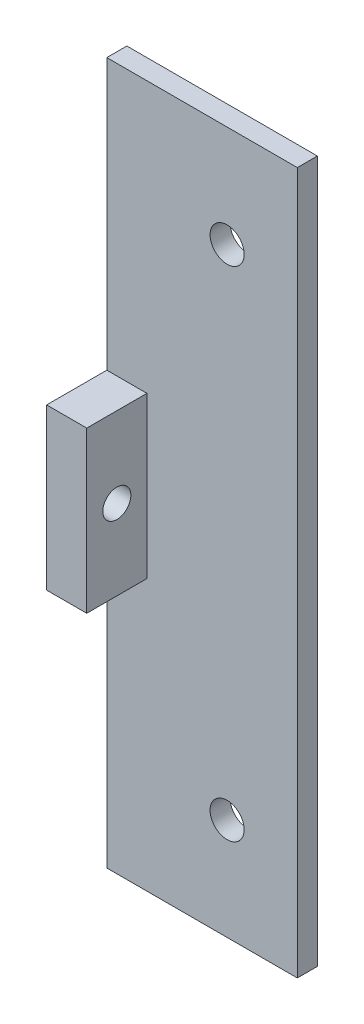
ISO-10303-21;
HEADER;
FILE_DESCRIPTION(('STEP AP214'),'2;1');
FILE_NAME('part.step','',(''),(''),'','','');
FILE_SCHEMA(('AUTOMOTIVE_DESIGN { 1 0 10303 214 1 1 1 1 }'));
ENDSEC;
DATA;
#1=APPLICATION_CONTEXT('core data for automotive mechanical design processes');
#2=APPLICATION_PROTOCOL_DEFINITION('international standard','automotive_design',2000,#1);
#3=PRODUCT_CONTEXT('',#1,'mechanical');
#4=PRODUCT('Part','Part','',(#3));
#5=PRODUCT_RELATED_PRODUCT_CATEGORY('part','',(#4));
#6=PRODUCT_DEFINITION_FORMATION('','',#4);
#7=PRODUCT_DEFINITION_CONTEXT('part definition',#1,'design');
#8=PRODUCT_DEFINITION('design','',#6,#7);
#9=PRODUCT_DEFINITION_SHAPE('','',#8);
#10=(LENGTH_UNIT() NAMED_UNIT(*) SI_UNIT(.MILLI.,.METRE.));
#11=(NAMED_UNIT(*) PLANE_ANGLE_UNIT() SI_UNIT($,.RADIAN.));
#12=(NAMED_UNIT(*) SI_UNIT($,.STERADIAN.) SOLID_ANGLE_UNIT());
#13=UNCERTAINTY_MEASURE_WITH_UNIT(LENGTH_MEASURE(1.E-05),#10,'distance_accuracy_value','');
#14=(GEOMETRIC_REPRESENTATION_CONTEXT(3) GLOBAL_UNCERTAINTY_ASSIGNED_CONTEXT((#13)) GLOBAL_UNIT_ASSIGNED_CONTEXT((#10,
#11,#12)) REPRESENTATION_CONTEXT('',''));
#15=CARTESIAN_POINT('',(0.,0.,0.));
#16=DIRECTION('',(0.,0.,1.));
#17=DIRECTION('',(1.,0.,0.));
#18=AXIS2_PLACEMENT_3D('',#15,#16,#17);
#19=CARTESIAN_POINT('',(0.,0.,2.));
#20=DIRECTION('',(0.,0.,1.));
#21=DIRECTION('',(1.,0.,0.));
#22=AXIS2_PLACEMENT_3D('',#19,#20,#21);
#23=PLANE('',#22);
#24=DIRECTION('',(1.,0.,0.));
#25=VECTOR('',#24,1.);
#26=CARTESIAN_POINT('',(0.,-32.85,2.));
#27=LINE('',#26,#25);
#28=CARTESIAN_POINT('',(-12.,-32.85,2.));
#29=VERTEX_POINT('',#28);
#30=CARTESIAN_POINT('',(-7.99999999999999,-32.85,2.));
#31=VERTEX_POINT('',#30);
#32=EDGE_CURVE('E119',#29,#31,#27,.T.);
#33=ORIENTED_EDGE('',*,*,#32,.F.);
#34=DIRECTION('',(0.,-1.,0.));
#35=VECTOR('',#34,1.);
#36=CARTESIAN_POINT('',(-12.,10.15,2.));
#37=LINE('',#36,#35);
#38=CARTESIAN_POINT('',(-12.,-59.85,2.));
#39=VERTEX_POINT('',#38);
#40=EDGE_CURVE('E180',#29,#39,#37,.T.);
#41=ORIENTED_EDGE('',*,*,#40,.T.);
#42=DIRECTION('',(1.,0.,0.));
#43=VECTOR('',#42,1.);
#44=CARTESIAN_POINT('',(-12.,-59.85,2.));
#45=LINE('',#44,#43);
#46=CARTESIAN_POINT('',(7.00000000000001,-59.85,2.));
#47=VERTEX_POINT('',#46);
#48=EDGE_CURVE('E185',#39,#47,#45,.T.);
#49=ORIENTED_EDGE('',*,*,#48,.T.);
#50=DIRECTION('',(0.,1.,0.));
#51=VECTOR('',#50,1.);
#52=CARTESIAN_POINT('',(7.,10.15,2.));
#53=LINE('',#52,#51);
#54=CARTESIAN_POINT('',(7.,10.15,2.));
#55=VERTEX_POINT('',#54);
#56=EDGE_CURVE('E187',#47,#55,#53,.T.);
#57=ORIENTED_EDGE('',*,*,#56,.T.);
#58=DIRECTION('',(-1.,0.,0.));
#59=VECTOR('',#58,1.);
#60=CARTESIAN_POINT('',(7.,10.15,2.));
#61=LINE('',#60,#59);
#62=CARTESIAN_POINT('',(-12.,10.15,2.));
#63=VERTEX_POINT('',#62);
#64=EDGE_CURVE('E177',#55,#63,#61,.T.);
#65=ORIENTED_EDGE('',*,*,#64,.T.);
#66=CARTESIAN_POINT('',(-12.,-16.85,2.));
#67=VERTEX_POINT('',#66);
#68=EDGE_CURVE('E182',#63,#67,#37,.T.);
#69=ORIENTED_EDGE('',*,*,#68,.T.);
#70=DIRECTION('',(-1.,0.,0.));
#71=VECTOR('',#70,1.);
#72=CARTESIAN_POINT('',(0.,-16.85,2.));
#73=LINE('',#72,#71);
#74=CARTESIAN_POINT('',(-8.,-16.85,2.));
#75=VERTEX_POINT('',#74);
#76=EDGE_CURVE('E66',#75,#67,#73,.T.);
#77=ORIENTED_EDGE('',*,*,#76,.F.);
#78=DIRECTION('',(0.,-1.,0.));
#79=VECTOR('',#78,1.);
#80=CARTESIAN_POINT('',(-8.,0.,2.));
#81=LINE('',#80,#79);
#82=EDGE_CURVE('E58',#75,#31,#81,.T.);
#83=ORIENTED_EDGE('',*,*,#82,.T.);
#84=EDGE_LOOP('',(#33,#41,#49,#57,#65,#69,#77,#83));
#85=FACE_BOUND('',#84,.T.);
#86=CARTESIAN_POINT('',(0.,0.,2.));
#87=DIRECTION('',(0.,0.,1.));
#88=DIRECTION('',(1.,0.,0.));
#89=AXIS2_PLACEMENT_3D('',#86,#87,#88);
#90=CIRCLE('',#89,1.7);
#91=CARTESIAN_POINT('',(1.7,0.,2.));
#92=VERTEX_POINT('',#91);
#93=EDGE_CURVE('E169',#92,#92,#90,.T.);
#94=ORIENTED_EDGE('',*,*,#93,.F.);
#95=EDGE_LOOP('',(#94));
#96=FACE_BOUND('',#95,.T.);
#97=CARTESIAN_POINT('',(0.,-49.7,2.));
#98=DIRECTION('',(0.,0.,1.));
#99=DIRECTION('',(1.,0.,0.));
#100=AXIS2_PLACEMENT_3D('',#97,#98,#99);
#101=CIRCLE('',#100,1.7);
#102=CARTESIAN_POINT('',(1.7,-49.7,2.));
#103=VERTEX_POINT('',#102);
#104=EDGE_CURVE('E162',#103,#103,#101,.T.);
#105=ORIENTED_EDGE('',*,*,#104,.F.);
#106=EDGE_LOOP('',(#105));
#107=FACE_BOUND('',#106,.T.);
#108=ADVANCED_FACE('F39',(#85,#96,#107),#23,.T.);
#109=CARTESIAN_POINT('',(0.,0.,0.));
#110=DIRECTION('',(0.,0.,1.));
#111=DIRECTION('',(1.,0.,0.));
#112=AXIS2_PLACEMENT_3D('',#109,#110,#111);
#113=PLANE('',#112);
#114=DIRECTION('',(1.,0.,0.));
#115=VECTOR('',#114,1.);
#116=CARTESIAN_POINT('',(-12.,-59.85,0.));
#117=LINE('',#116,#115);
#118=CARTESIAN_POINT('',(-12.,-59.85,0.));
#119=VERTEX_POINT('',#118);
#120=CARTESIAN_POINT('',(7.00000000000001,-59.85,0.));
#121=VERTEX_POINT('',#120);
#122=EDGE_CURVE('E197',#119,#121,#117,.T.);
#123=ORIENTED_EDGE('',*,*,#122,.F.);
#124=DIRECTION('',(0.,-1.,0.));
#125=VECTOR('',#124,1.);
#126=CARTESIAN_POINT('',(-12.,10.15,0.));
#127=LINE('',#126,#125);
#128=CARTESIAN_POINT('',(-12.,10.15,0.));
#129=VERTEX_POINT('',#128);
#130=EDGE_CURVE('E194',#129,#119,#127,.T.);
#131=ORIENTED_EDGE('',*,*,#130,.F.);
#132=DIRECTION('',(-1.,0.,0.));
#133=VECTOR('',#132,1.);
#134=CARTESIAN_POINT('',(7.,10.15,0.));
#135=LINE('',#134,#133);
#136=CARTESIAN_POINT('',(7.,10.15,0.));
#137=VERTEX_POINT('',#136);
#138=EDGE_CURVE('E173',#137,#129,#135,.T.);
#139=ORIENTED_EDGE('',*,*,#138,.F.);
#140=DIRECTION('',(0.,1.,0.));
#141=VECTOR('',#140,1.);
#142=CARTESIAN_POINT('',(7.,10.15,0.));
#143=LINE('',#142,#141);
#144=EDGE_CURVE('E181',#121,#137,#143,.T.);
#145=ORIENTED_EDGE('',*,*,#144,.F.);
#146=EDGE_LOOP('',(#123,#131,#139,#145));
#147=FACE_BOUND('',#146,.T.);
#148=CARTESIAN_POINT('',(0.,0.,0.));
#149=DIRECTION('',(0.,0.,1.));
#150=DIRECTION('',(1.,0.,0.));
#151=AXIS2_PLACEMENT_3D('',#148,#149,#150);
#152=CIRCLE('',#151,1.7);
#153=CARTESIAN_POINT('',(1.7,0.,0.));
#154=VERTEX_POINT('',#153);
#155=EDGE_CURVE('E165',#154,#154,#152,.T.);
#156=ORIENTED_EDGE('',*,*,#155,.T.);
#157=EDGE_LOOP('',(#156));
#158=FACE_BOUND('',#157,.T.);
#159=CARTESIAN_POINT('',(0.,-49.7,0.));
#160=DIRECTION('',(0.,0.,1.));
#161=DIRECTION('',(1.,0.,0.));
#162=AXIS2_PLACEMENT_3D('',#159,#160,#161);
#163=CIRCLE('',#162,1.7);
#164=CARTESIAN_POINT('',(1.7,-49.7,0.));
#165=VERTEX_POINT('',#164);
#166=EDGE_CURVE('E161',#165,#165,#163,.T.);
#167=ORIENTED_EDGE('',*,*,#166,.T.);
#168=EDGE_LOOP('',(#167));
#169=FACE_BOUND('',#168,.T.);
#170=ADVANCED_FACE('F218',(#147,#158,#169),#113,.F.);
#171=CARTESIAN_POINT('',(7.,10.15,2.));
#172=DIRECTION('',(0.,-1.,0.));
#173=DIRECTION('',(0.,0.,-1.));
#174=AXIS2_PLACEMENT_3D('',#171,#172,#173);
#175=PLANE('',#174);
#176=ORIENTED_EDGE('',*,*,#138,.T.);
#177=DIRECTION('',(0.,0.,-1.));
#178=VECTOR('',#177,1.);
#179=CARTESIAN_POINT('',(-12.,10.15,2.));
#180=LINE('',#179,#178);
#181=EDGE_CURVE('E11',#63,#129,#180,.T.);
#182=ORIENTED_EDGE('',*,*,#181,.F.);
#183=ORIENTED_EDGE('',*,*,#64,.F.);
#184=DIRECTION('',(0.,0.,-1.));
#185=VECTOR('',#184,1.);
#186=CARTESIAN_POINT('',(7.,10.15,2.));
#187=LINE('',#186,#185);
#188=EDGE_CURVE('E190',#55,#137,#187,.T.);
#189=ORIENTED_EDGE('',*,*,#188,.T.);
#190=EDGE_LOOP('',(#176,#182,#183,#189));
#191=FACE_BOUND('',#190,.T.);
#192=ADVANCED_FACE('F41',(#191),#175,.F.);
#193=CARTESIAN_POINT('',(-12.,10.15,2.));
#194=DIRECTION('',(1.,0.,0.));
#195=DIRECTION('',(0.,1.,0.));
#196=AXIS2_PLACEMENT_3D('',#193,#194,#195);
#197=PLANE('',#196);
#198=CARTESIAN_POINT('',(-12.,-24.85,5.));
#199=DIRECTION('',(-1.,0.,0.));
#200=DIRECTION('',(0.,-1.,0.));
#201=AXIS2_PLACEMENT_3D('',#198,#199,#200);
#202=CIRCLE('',#201,1.4);
#203=CARTESIAN_POINT('',(-12.,-26.25,5.));
#204=VERTEX_POINT('',#203);
#205=EDGE_CURVE('E231',#204,#204,#202,.T.);
#206=ORIENTED_EDGE('',*,*,#205,.F.);
#207=EDGE_LOOP('',(#206));
#208=FACE_BOUND('',#207,.T.);
#209=ORIENTED_EDGE('',*,*,#130,.T.);
#210=DIRECTION('',(0.,0.,-1.));
#211=VECTOR('',#210,1.);
#212=CARTESIAN_POINT('',(-12.,-59.85,2.));
#213=LINE('',#212,#211);
#214=EDGE_CURVE('E48',#39,#119,#213,.T.);
#215=ORIENTED_EDGE('',*,*,#214,.F.);
#216=ORIENTED_EDGE('',*,*,#40,.F.);
#217=DIRECTION('',(0.,0.,1.));
#218=VECTOR('',#217,1.);
#219=CARTESIAN_POINT('',(-12.,-32.85,0.));
#220=LINE('',#219,#218);
#221=CARTESIAN_POINT('',(-12.,-32.85,8.00000000000001));
#222=VERTEX_POINT('',#221);
#223=EDGE_CURVE('E145',#29,#222,#220,.T.);
#224=ORIENTED_EDGE('',*,*,#223,.T.);
#225=DIRECTION('',(0.,1.,0.));
#226=VECTOR('',#225,1.);
#227=CARTESIAN_POINT('',(-12.,-32.85,8.00000000000001));
#228=LINE('',#227,#226);
#229=CARTESIAN_POINT('',(-12.,-16.85,8.00000000000001));
#230=VERTEX_POINT('',#229);
#231=EDGE_CURVE('E130',#222,#230,#228,.T.);
#232=ORIENTED_EDGE('',*,*,#231,.T.);
#233=DIRECTION('',(0.,0.,-1.));
#234=VECTOR('',#233,1.);
#235=CARTESIAN_POINT('',(-12.,-16.85,0.));
#236=LINE('',#235,#234);
#237=EDGE_CURVE('E124',#230,#67,#236,.T.);
#238=ORIENTED_EDGE('',*,*,#237,.T.);
#239=ORIENTED_EDGE('',*,*,#68,.F.);
#240=ORIENTED_EDGE('',*,*,#181,.T.);
#241=EDGE_LOOP('',(#209,#215,#216,#224,#232,#238,#239,#240));
#242=FACE_BOUND('',#241,.T.);
#243=ADVANCED_FACE('F241',(#208,#242),#197,.F.);
#244=CARTESIAN_POINT('',(-12.,-59.85,2.));
#245=DIRECTION('',(0.,1.,0.));
#246=DIRECTION('',(0.,0.,1.));
#247=AXIS2_PLACEMENT_3D('',#244,#245,#246);
#248=PLANE('',#247);
#249=ORIENTED_EDGE('',*,*,#122,.T.);
#250=DIRECTION('',(0.,0.,-1.));
#251=VECTOR('',#250,1.);
#252=CARTESIAN_POINT('',(7.00000000000001,-59.85,2.));
#253=LINE('',#252,#251);
#254=EDGE_CURVE('E205',#47,#121,#253,.T.);
#255=ORIENTED_EDGE('',*,*,#254,.F.);
#256=ORIENTED_EDGE('',*,*,#48,.F.);
#257=ORIENTED_EDGE('',*,*,#214,.T.);
#258=EDGE_LOOP('',(#249,#255,#256,#257));
#259=FACE_BOUND('',#258,.T.);
#260=ADVANCED_FACE('F213',(#259),#248,.F.);
#261=CARTESIAN_POINT('',(7.,10.15,2.));
#262=DIRECTION('',(-1.,0.,0.));
#263=DIRECTION('',(0.,-1.,0.));
#264=AXIS2_PLACEMENT_3D('',#261,#262,#263);
#265=PLANE('',#264);
#266=ORIENTED_EDGE('',*,*,#144,.T.);
#267=ORIENTED_EDGE('',*,*,#188,.F.);
#268=ORIENTED_EDGE('',*,*,#56,.F.);
#269=ORIENTED_EDGE('',*,*,#254,.T.);
#270=EDGE_LOOP('',(#266,#267,#268,#269));
#271=FACE_BOUND('',#270,.T.);
#272=ADVANCED_FACE('F223',(#271),#265,.F.);
#273=CARTESIAN_POINT('',(0.,0.,2.));
#274=DIRECTION('',(0.,0.,-1.));
#275=DIRECTION('',(-1.,0.,0.));
#276=AXIS2_PLACEMENT_3D('',#273,#274,#275);
#277=CYLINDRICAL_SURFACE('',#276,1.7);
#278=ORIENTED_EDGE('',*,*,#93,.T.);
#279=EDGE_LOOP('',(#278));
#280=FACE_BOUND('',#279,.T.);
#281=ORIENTED_EDGE('',*,*,#155,.F.);
#282=EDGE_LOOP('',(#281));
#283=FACE_BOUND('',#282,.T.);
#284=ADVANCED_FACE('F263',(#280,#283),#277,.F.);
#285=CARTESIAN_POINT('',(0.,-49.7,2.));
#286=DIRECTION('',(0.,0.,-1.));
#287=DIRECTION('',(-1.,0.,0.));
#288=AXIS2_PLACEMENT_3D('',#285,#286,#287);
#289=CYLINDRICAL_SURFACE('',#288,1.7);
#290=ORIENTED_EDGE('',*,*,#104,.T.);
#291=EDGE_LOOP('',(#290));
#292=FACE_BOUND('',#291,.T.);
#293=ORIENTED_EDGE('',*,*,#166,.F.);
#294=EDGE_LOOP('',(#293));
#295=FACE_BOUND('',#294,.T.);
#296=ADVANCED_FACE('F253',(#292,#295),#289,.F.);
#297=CARTESIAN_POINT('',(-7.99999999999999,-32.85,0.));
#298=DIRECTION('',(0.,-1.,0.));
#299=DIRECTION('',(1.,0.,0.));
#300=AXIS2_PLACEMENT_3D('',#297,#298,#299);
#301=PLANE('',#300);
#302=ORIENTED_EDGE('',*,*,#223,.F.);
#303=ORIENTED_EDGE('',*,*,#32,.T.);
#304=DIRECTION('',(0.,0.,1.));
#305=VECTOR('',#304,1.);
#306=CARTESIAN_POINT('',(-7.99999999999999,-32.85,0.));
#307=LINE('',#306,#305);
#308=CARTESIAN_POINT('',(-7.99999999999999,-32.85,8.00000000000001));
#309=VERTEX_POINT('',#308);
#310=EDGE_CURVE('E113',#31,#309,#307,.T.);
#311=ORIENTED_EDGE('',*,*,#310,.T.);
#312=DIRECTION('',(-1.,0.,0.));
#313=VECTOR('',#312,1.);
#314=CARTESIAN_POINT('',(-7.99999999999999,-32.85,8.00000000000001));
#315=LINE('',#314,#313);
#316=EDGE_CURVE('E117',#309,#222,#315,.T.);
#317=ORIENTED_EDGE('',*,*,#316,.T.);
#318=EDGE_LOOP('',(#302,#303,#311,#317));
#319=FACE_BOUND('',#318,.T.);
#320=ADVANCED_FACE('F116',(#319),#301,.T.);
#321=CARTESIAN_POINT('',(-8.,-16.85,0.));
#322=DIRECTION('',(0.,1.,0.));
#323=DIRECTION('',(-1.,0.,0.));
#324=AXIS2_PLACEMENT_3D('',#321,#322,#323);
#325=PLANE('',#324);
#326=DIRECTION('',(0.,0.,-1.));
#327=VECTOR('',#326,1.);
#328=CARTESIAN_POINT('',(-8.,-16.85,0.));
#329=LINE('',#328,#327);
#330=CARTESIAN_POINT('',(-8.,-16.85,8.00000000000001));
#331=VERTEX_POINT('',#330);
#332=EDGE_CURVE('E132',#331,#75,#329,.T.);
#333=ORIENTED_EDGE('',*,*,#332,.T.);
#334=ORIENTED_EDGE('',*,*,#76,.T.);
#335=ORIENTED_EDGE('',*,*,#237,.F.);
#336=DIRECTION('',(-1.,0.,0.));
#337=VECTOR('',#336,1.);
#338=CARTESIAN_POINT('',(-8.,-16.85,8.00000000000001));
#339=LINE('',#338,#337);
#340=EDGE_CURVE('E131',#331,#230,#339,.T.);
#341=ORIENTED_EDGE('',*,*,#340,.F.);
#342=EDGE_LOOP('',(#333,#334,#335,#341));
#343=FACE_BOUND('',#342,.T.);
#344=ADVANCED_FACE('F245',(#343),#325,.T.);
#345=CARTESIAN_POINT('',(-7.99999999999999,-32.85,8.00000000000001));
#346=DIRECTION('',(0.,0.,1.));
#347=DIRECTION('',(1.,0.,0.));
#348=AXIS2_PLACEMENT_3D('',#345,#346,#347);
#349=PLANE('',#348);
#350=ORIENTED_EDGE('',*,*,#231,.F.);
#351=ORIENTED_EDGE('',*,*,#316,.F.);
#352=DIRECTION('',(0.,1.,0.));
#353=VECTOR('',#352,1.);
#354=CARTESIAN_POINT('',(-7.99999999999999,-32.85,8.00000000000001));
#355=LINE('',#354,#353);
#356=EDGE_CURVE('E123',#309,#331,#355,.T.);
#357=ORIENTED_EDGE('',*,*,#356,.T.);
#358=ORIENTED_EDGE('',*,*,#340,.T.);
#359=EDGE_LOOP('',(#350,#351,#357,#358));
#360=FACE_BOUND('',#359,.T.);
#361=ADVANCED_FACE('F128',(#360),#349,.T.);
#362=CARTESIAN_POINT('',(-8.,0.,0.));
#363=DIRECTION('',(-1.,0.,0.));
#364=DIRECTION('',(0.,-1.,0.));
#365=AXIS2_PLACEMENT_3D('',#362,#363,#364);
#366=PLANE('',#365);
#367=CARTESIAN_POINT('',(-7.99999999999999,-24.85,5.));
#368=DIRECTION('',(-1.,0.,0.));
#369=DIRECTION('',(0.,-1.,0.));
#370=AXIS2_PLACEMENT_3D('',#367,#368,#369);
#371=CIRCLE('',#370,1.4);
#372=CARTESIAN_POINT('',(-7.99999999999999,-26.25,5.));
#373=VERTEX_POINT('',#372);
#374=EDGE_CURVE('E148',#373,#373,#371,.T.);
#375=ORIENTED_EDGE('',*,*,#374,.T.);
#376=EDGE_LOOP('',(#375));
#377=FACE_BOUND('',#376,.T.);
#378=ORIENTED_EDGE('',*,*,#82,.F.);
#379=ORIENTED_EDGE('',*,*,#332,.F.);
#380=ORIENTED_EDGE('',*,*,#356,.F.);
#381=ORIENTED_EDGE('',*,*,#310,.F.);
#382=EDGE_LOOP('',(#378,#379,#380,#381));
#383=FACE_BOUND('',#382,.T.);
#384=ADVANCED_FACE('F135',(#377,#383),#366,.F.);
#385=CARTESIAN_POINT('',(-7.99999999999999,-24.85,5.));
#386=DIRECTION('',(-1.,0.,0.));
#387=DIRECTION('',(0.,-1.,0.));
#388=AXIS2_PLACEMENT_3D('',#385,#386,#387);
#389=CYLINDRICAL_SURFACE('',#388,1.4);
#390=ORIENTED_EDGE('',*,*,#374,.F.);
#391=EDGE_LOOP('',(#390));
#392=FACE_BOUND('',#391,.T.);
#393=ORIENTED_EDGE('',*,*,#205,.T.);
#394=EDGE_LOOP('',(#393));
#395=FACE_BOUND('',#394,.T.);
#396=ADVANCED_FACE('F239',(#392,#395),#389,.F.);
#397=CLOSED_SHELL('',(#108,#170,#192,#243,#260,#272,#284,#296,#320,#344,#361,#384,#396));
#398=MANIFOLD_SOLID_BREP('B2',#397);
#399=ADVANCED_BREP_SHAPE_REPRESENTATION('',(#18,#398),#14);
#400=SHAPE_DEFINITION_REPRESENTATION(#9,#399);
ENDSEC;
END-ISO-10303-21;
